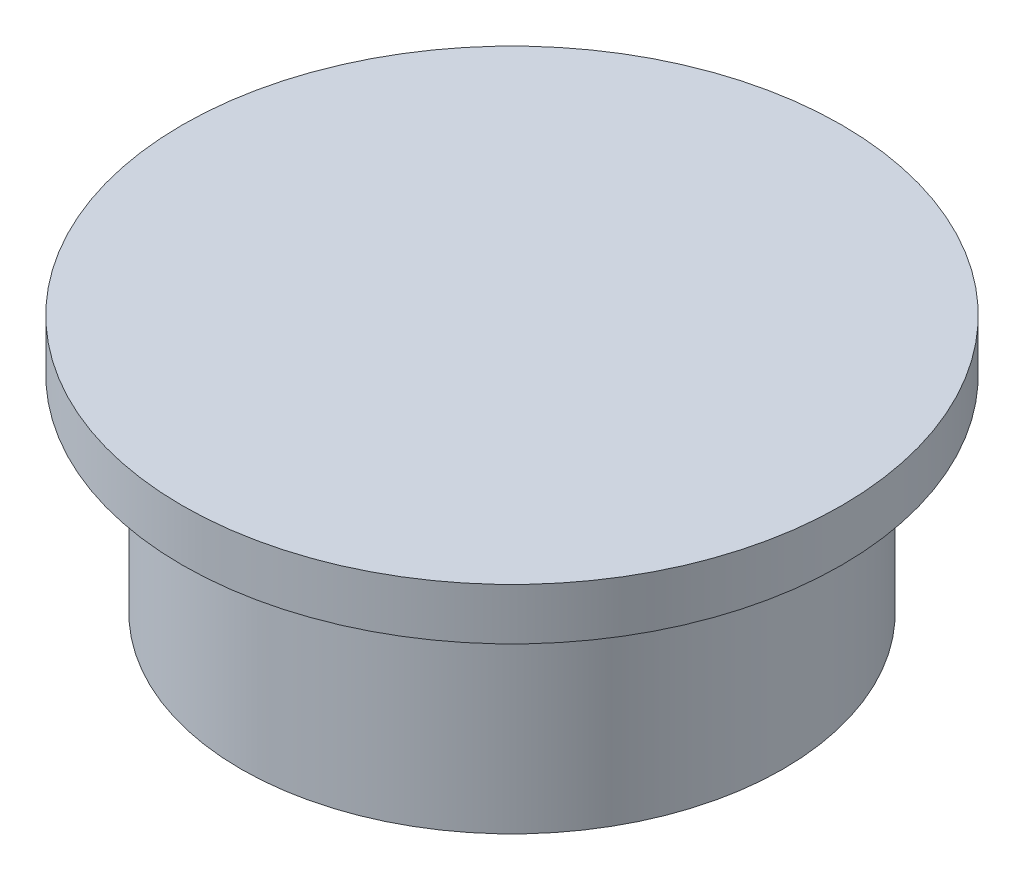
ISO-10303-21;
HEADER;
FILE_DESCRIPTION(('STEP AP214'),'2;1');
FILE_NAME('part.step','',(''),(''),'','','');
FILE_SCHEMA(('AUTOMOTIVE_DESIGN { 1 0 10303 214 1 1 1 1 }'));
ENDSEC;
DATA;
#1=APPLICATION_CONTEXT('core data for automotive mechanical design processes');
#2=APPLICATION_PROTOCOL_DEFINITION('international standard','automotive_design',2000,#1);
#3=PRODUCT_CONTEXT('',#1,'mechanical');
#4=PRODUCT('Part','Part','',(#3));
#5=PRODUCT_RELATED_PRODUCT_CATEGORY('part','',(#4));
#6=PRODUCT_DEFINITION_FORMATION('','',#4);
#7=PRODUCT_DEFINITION_CONTEXT('part definition',#1,'design');
#8=PRODUCT_DEFINITION('design','',#6,#7);
#9=PRODUCT_DEFINITION_SHAPE('','',#8);
#10=(LENGTH_UNIT() NAMED_UNIT(*) SI_UNIT(.MILLI.,.METRE.));
#11=(NAMED_UNIT(*) PLANE_ANGLE_UNIT() SI_UNIT($,.RADIAN.));
#12=(NAMED_UNIT(*) SI_UNIT($,.STERADIAN.) SOLID_ANGLE_UNIT());
#13=UNCERTAINTY_MEASURE_WITH_UNIT(LENGTH_MEASURE(1.E-05),#10,'distance_accuracy_value','');
#14=(GEOMETRIC_REPRESENTATION_CONTEXT(3) GLOBAL_UNCERTAINTY_ASSIGNED_CONTEXT((#13)) GLOBAL_UNIT_ASSIGNED_CONTEXT((#10,
#11,#12)) REPRESENTATION_CONTEXT('',''));
#15=CARTESIAN_POINT('',(0.,0.,0.));
#16=DIRECTION('',(0.,0.,1.));
#17=DIRECTION('',(1.,0.,0.));
#18=AXIS2_PLACEMENT_3D('',#15,#16,#17);
#19=CARTESIAN_POINT('',(0.,15.,0.));
#20=DIRECTION('',(0.,-1.,0.));
#21=DIRECTION('',(0.,0.,-1.));
#22=AXIS2_PLACEMENT_3D('',#19,#20,#21);
#23=PLANE('',#22);
#24=CARTESIAN_POINT('',(10.1331714344684,15.,3.74819249899276));
#25=CARTESIAN_POINT('',(7.98423562247712,15.,2.54909033571566));
#26=CARTESIAN_POINT('',(4.38190398424181,15.,0.604779847946047));
#27=CARTESIAN_POINT('',(1.44661254612541,15.,-1.66132992921648));
#28=B_SPLINE_CURVE_WITH_KNOTS('',3,(#24,#25,#26,#27),.UNSPECIFIED.,.F.,.F.,(4,4),
(0.0109043370463159,1.),.UNSPECIFIED.);
#29=CARTESIAN_POINT('',(10.1331714344684,15.,3.74819249899276));
#30=VERTEX_POINT('',#29);
#31=CARTESIAN_POINT('',(9.99686683376103,15.,3.67221370675083));
#32=VERTEX_POINT('',#31);
#33=EDGE_CURVE('E182',#30,#32,#28,.T.);
#34=ORIENTED_EDGE('',*,*,#33,.T.);
#35=CARTESIAN_POINT('',(0.,15.,0.));
#36=DIRECTION('',(0.,-1.,0.));
#37=DIRECTION('',(0.,0.,-1.));
#38=AXIS2_PLACEMENT_3D('',#35,#36,#37);
#39=CIRCLE('',#38,10.65);
#40=CARTESIAN_POINT('',(9.9680870996866,15.,3.74963192501099));
#41=VERTEX_POINT('',#40);
#42=EDGE_CURVE('E172',#32,#41,#39,.T.);
#43=ORIENTED_EDGE('',*,*,#42,.T.);
#44=DIRECTION('',(0.999961988744844,0.,-0.00871900599012528));
#45=VECTOR('',#44,1.);
#46=CARTESIAN_POINT('',(0.0334496051124429,15.,3.83625538150221));
#47=LINE('',#46,#45);
#48=EDGE_CURVE('E188',#41,#30,#47,.T.);
#49=ORIENTED_EDGE('',*,*,#48,.T.);
#50=EDGE_LOOP('',(#34,#43,#49));
#51=FACE_BOUND('',#50,.T.);
#52=ADVANCED_FACE('F48',(#51),#23,.F.);
#53=CARTESIAN_POINT('',(0.,17.,0.));
#54=DIRECTION('',(0.,1.,0.));
#55=DIRECTION('',(0.,0.,1.));
#56=AXIS2_PLACEMENT_3D('',#53,#54,#55);
#57=PLANE('',#56);
#58=CARTESIAN_POINT('',(-7.70690275443407,17.,-1.80839119653901));
#59=CARTESIAN_POINT('',(-8.13282046458095,17.,-1.53162241335836));
#60=CARTESIAN_POINT('',(-9.29507776566452,17.,-1.12036554925747));
#61=CARTESIAN_POINT('',(-10.0224617773798,17.,-0.728590804537964));
#62=B_SPLINE_CURVE_WITH_KNOTS('',3,(#58,#59,#60,#61),.UNSPECIFIED.,.F.,.F.,(4,4),
(0.109346460177382,0.840811762511879),.UNSPECIFIED.);
#63=CARTESIAN_POINT('',(-7.70690275443407,17.,-1.80839119653901));
#64=VERTEX_POINT('',#63);
#65=CARTESIAN_POINT('',(-10.0224617773798,17.,-0.728590804537966));
#66=VERTEX_POINT('',#65);
#67=EDGE_CURVE('E386',#64,#66,#62,.T.);
#68=ORIENTED_EDGE('',*,*,#67,.F.);
#69=CARTESIAN_POINT('',(-7.97934313992203,17.,-2.22764796315591));
#70=DIRECTION('',(0.,1.,0.));
#71=DIRECTION('',(0.,0.,1.));
#72=AXIS2_PLACEMENT_3D('',#69,#70,#71);
#73=CIRCLE('',#72,0.499999999998884);
#74=CARTESIAN_POINT('',(-7.5277335533392,17.,-2.01305816538964));
#75=VERTEX_POINT('',#74);
#76=EDGE_CURVE('E384',#64,#75,#73,.T.);
#77=ORIENTED_EDGE('',*,*,#76,.T.);
#78=CARTESIAN_POINT('',(-5.97356289784426,17.,-3.42764441158581));
#79=CARTESIAN_POINT('',(-6.70551439328931,17.,-3.18182806236595));
#80=CARTESIAN_POINT('',(-7.18803768607021,17.,-2.72795659847889));
#81=CARTESIAN_POINT('',(-7.5277335533392,17.,-2.01305816538964));
#82=B_SPLINE_CURVE_WITH_KNOTS('',3,(#78,#79,#80,#81),.UNSPECIFIED.,.F.,.F.,(4,4),
(0.175947617350418,0.967261409234941),.UNSPECIFIED.);
#83=CARTESIAN_POINT('',(-5.97356289784426,17.,-3.42764441158581));
#84=VERTEX_POINT('',#83);
#85=EDGE_CURVE('E245',#84,#75,#82,.T.);
#86=ORIENTED_EDGE('',*,*,#85,.F.);
#87=CARTESIAN_POINT('',(-5.33683695758252,17.,-1.53170662858842));
#88=DIRECTION('',(0.,1.,0.));
#89=DIRECTION('',(0.,0.,1.));
#90=AXIS2_PLACEMENT_3D('',#87,#88,#89);
#91=CIRCLE('',#90,1.99999999999981);
#92=CARTESIAN_POINT('',(-5.06636809167789,17.,-3.51333388732693));
#93=VERTEX_POINT('',#92);
#94=EDGE_CURVE('E374',#93,#84,#91,.T.);
#95=ORIENTED_EDGE('',*,*,#94,.F.);
#96=CARTESIAN_POINT('',(0.252246956629509,17.,-2.54649892275102));
#97=CARTESIAN_POINT('',(-0.967265157025587,17.,-2.5855446338096));
#98=CARTESIAN_POINT('',(-2.91173589828176,17.,-3.21925187810187));
#99=CARTESIAN_POINT('',(-5.06636809167788,17.,-3.51333388732693));
#100=B_SPLINE_CURVE_WITH_KNOTS('',3,(#96,#97,#98,#99),.UNSPECIFIED.,.F.,.F.,(4,4),(0.,
0.94465243398934),.UNSPECIFIED.);
#101=CARTESIAN_POINT('',(0.252246943565959,17.,-2.54649892265936));
#102=VERTEX_POINT('',#101);
#103=EDGE_CURVE('E367',#102,#93,#100,.T.);
#104=ORIENTED_EDGE('',*,*,#103,.F.);
#105=CARTESIAN_POINT('',(-437051.448594121,17.,-899448.046076552));
#106=CARTESIAN_POINT('',(440922.130501443,17.,897544.135699193));
#107=CARTESIAN_POINT('',(-444773.896505409,17.,-895654.418476363));
#108=B_SPLINE_CURVE_WITH_KNOTS('',2,(#105,#106,#107),.UNSPECIFIED.,.F.,.F.,(3,3),(0.,1.),.UNSPECIFIED.);
#109=CARTESIAN_POINT('',(2.98484379670261,17.,-2.89801067573242));
#110=VERTEX_POINT('',#109);
#111=EDGE_CURVE('E359',#110,#102,#108,.T.);
#112=ORIENTED_EDGE('',*,*,#111,.F.);
#113=CARTESIAN_POINT('',(1.44657608810188,17.,-1.81961275599096));
#114=CARTESIAN_POINT('',(1.6922336041153,17.,-2.00944650442161));
#115=CARTESIAN_POINT('',(2.25567544120908,17.,-2.35606123667802));
#116=CARTESIAN_POINT('',(2.98484376661068,17.,-2.89801066775086));
#117=B_SPLINE_CURVE_WITH_KNOTS('',3,(#113,#114,#115,#116),.UNSPECIFIED.,.F.,.F.,(4,4),
(0.144955644440009,1.),.UNSPECIFIED.);
#118=CARTESIAN_POINT('',(1.44657608563146,17.,-1.81961275917009));
#119=VERTEX_POINT('',#118);
#120=EDGE_CURVE('E354',#119,#110,#117,.T.);
#121=ORIENTED_EDGE('',*,*,#120,.F.);
#122=CARTESIAN_POINT('',(1.50772234796804,17.,-1.74048542250789));
#123=DIRECTION('',(0.,1.,0.));
#124=DIRECTION('',(0.,0.,1.));
#125=AXIS2_PLACEMENT_3D('',#122,#123,#124);
#126=CIRCLE('',#125,0.100000004024937);
#127=CARTESIAN_POINT('',(1.44661254430695,17.,-1.66132992553206));
#128=VERTEX_POINT('',#127);
#129=EDGE_CURVE('E349',#119,#128,#126,.T.);
#130=ORIENTED_EDGE('',*,*,#129,.T.);
#131=CARTESIAN_POINT('',(10.1331714344684,17.,3.74819249899276));
#132=CARTESIAN_POINT('',(7.98423562247712,17.,2.54909033571566));
#133=CARTESIAN_POINT('',(4.38190398424181,17.,0.604779847946047));
#134=CARTESIAN_POINT('',(1.44661254612541,17.,-1.66132992921648));
#135=B_SPLINE_CURVE_WITH_KNOTS('',3,(#131,#132,#133,#134),.UNSPECIFIED.,.F.,.F.,(4,4),
(0.0109043370463159,1.),.UNSPECIFIED.);
#136=CARTESIAN_POINT('',(10.1331714344684,17.,3.74819249899276));
#137=VERTEX_POINT('',#136);
#138=EDGE_CURVE('E333',#137,#128,#135,.T.);
#139=ORIENTED_EDGE('',*,*,#138,.F.);
#140=DIRECTION('',(0.999961988744844,0.,-0.00871900599012528));
#141=VECTOR('',#140,1.);
#142=CARTESIAN_POINT('',(0.0334496051124429,17.,3.83625538150221));
#143=LINE('',#142,#141);
#144=CARTESIAN_POINT('',(-3.27342147947646,17.,3.86508910630338));
#145=VERTEX_POINT('',#144);
#146=EDGE_CURVE('E330',#145,#137,#143,.T.);
#147=ORIENTED_EDGE('',*,*,#146,.F.);
#148=CARTESIAN_POINT('',(-7.52773355333564,17.,-0.0785493574014385));
#149=CARTESIAN_POINT('',(-6.02135132804977,17.,-0.0345375374684732));
#150=CARTESIAN_POINT('',(-5.03417295231662,17.,1.16113154394786));
#151=CARTESIAN_POINT('',(-3.27342147947646,17.,3.86508910630338));
#152=B_SPLINE_CURVE_WITH_KNOTS('',3,(#148,#149,#150,#151),.UNSPECIFIED.,.F.,.F.,(4,4),(0.,1.),.UNSPECIFIED.);
#153=CARTESIAN_POINT('',(-7.52773355333564,17.,-0.0785493574014385));
#154=VERTEX_POINT('',#153);
#155=EDGE_CURVE('E328',#154,#145,#152,.T.);
#156=ORIENTED_EDGE('',*,*,#155,.F.);
#157=CARTESIAN_POINT('',(-9.00135959818123,17.,0.0966449292042534));
#158=CARTESIAN_POINT('',(-8.60951132692284,17.,0.0109841909571523));
#159=CARTESIAN_POINT('',(-8.14744293446896,17.,-0.0430608363407199));
#160=CARTESIAN_POINT('',(-7.52773355333564,17.,-0.0785493574014385));
#161=B_SPLINE_CURVE_WITH_KNOTS('',3,(#157,#158,#159,#160),.UNSPECIFIED.,.F.,.F.,(4,4),
(0.366671919414141,1.),.UNSPECIFIED.);
#162=CARTESIAN_POINT('',(-9.00135959818123,17.,0.0966449292042514));
#163=VERTEX_POINT('',#162);
#164=EDGE_CURVE('E331',#163,#154,#161,.T.);
#165=ORIENTED_EDGE('',*,*,#164,.F.);
#166=CARTESIAN_POINT('',(-8.84118699715415,17.,0.829341822796713));
#167=DIRECTION('',(0.,1.,0.));
#168=DIRECTION('',(0.,0.,1.));
#169=AXIS2_PLACEMENT_3D('',#166,#167,#168);
#170=CIRCLE('',#169,0.749999999999881);
#171=CARTESIAN_POINT('',(-9.589622683719,17.,0.877756934859196));
#172=VERTEX_POINT('',#171);
#173=EDGE_CURVE('E335',#163,#172,#170,.T.);
#174=ORIENTED_EDGE('',*,*,#173,.T.);
#175=DIRECTION('',(-0.0645534827440402,0.,-0.997914248753677));
#176=VECTOR('',#175,1.);
#177=CARTESIAN_POINT('',(-9.60620535083817,17.,0.621410118279718));
#178=LINE('',#177,#176);
#179=CARTESIAN_POINT('',(-9.55587963421446,17.,1.39938130686246));
#180=VERTEX_POINT('',#179);
#181=EDGE_CURVE('E408',#180,#172,#178,.T.);
#182=ORIENTED_EDGE('',*,*,#181,.F.);
#183=DIRECTION('',(0.419665574548186,0.,0.907678800864679));
#184=VECTOR('',#183,1.);
#185=CARTESIAN_POINT('',(-8.40596030078368,17.,3.88649834709927));
#186=LINE('',#185,#184);
#187=CARTESIAN_POINT('',(-10.2392013343247,17.,-0.0785493574019338));
#188=VERTEX_POINT('',#187);
#189=EDGE_CURVE('E70',#188,#180,#186,.T.);
#190=ORIENTED_EDGE('',*,*,#189,.F.);
#191=CARTESIAN_POINT('',(-9.78536193389068,17.,-0.288382144674837));
#192=DIRECTION('',(0.,1.,0.));
#193=DIRECTION('',(0.,0.,1.));
#194=AXIS2_PLACEMENT_3D('',#191,#192,#193);
#195=CIRCLE('',#194,0.500000000001046);
#196=EDGE_CURVE('E389',#66,#188,#195,.T.);
#197=ORIENTED_EDGE('',*,*,#196,.F.);
#198=EDGE_LOOP('',(#68,#77,#86,#95,#104,#112,#121,#130,#139,#147,#156,#165,#174,#182,#190,#197));
#199=FACE_BOUND('',#198,.T.);
#200=ADVANCED_FACE('F383',(#199),#57,.F.);
#201=CARTESIAN_POINT('',(0.0334496051124429,13.7,3.83625538150221));
#202=DIRECTION('',(0.00871900599012528,0.,0.999961988744844));
#203=DIRECTION('',(0.999961988744844,0.,-0.00871900599012528));
#204=AXIS2_PLACEMENT_3D('',#201,#202,#203);
#205=PLANE('',#204);
#206=DIRECTION('',(0.,1.,0.));
#207=VECTOR('',#206,1.);
#208=CARTESIAN_POINT('',(10.1331714344684,13.7,3.74819249899276));
#209=LINE('',#208,#207);
#210=EDGE_CURVE('E270',#30,#137,#209,.T.);
#211=ORIENTED_EDGE('',*,*,#210,.F.);
#212=ORIENTED_EDGE('',*,*,#48,.F.);
#213=CARTESIAN_POINT('',(-3.27342147947646,15.,3.86508910630338));
#214=VERTEX_POINT('',#213);
#215=EDGE_CURVE('E170',#214,#41,#47,.T.);
#216=ORIENTED_EDGE('',*,*,#215,.F.);
#217=DIRECTION('',(0.,1.,0.));
#218=VECTOR('',#217,1.);
#219=CARTESIAN_POINT('',(-3.27342147947646,13.7,3.86508910630338));
#220=LINE('',#219,#218);
#221=EDGE_CURVE('E272',#214,#145,#220,.T.);
#222=ORIENTED_EDGE('',*,*,#221,.T.);
#223=ORIENTED_EDGE('',*,*,#146,.T.);
#224=EDGE_LOOP('',(#211,#212,#216,#222,#223));
#225=FACE_BOUND('',#224,.T.);
#226=ADVANCED_FACE('F324',(#225),#205,.F.);
#227=CARTESIAN_POINT('',(10.1331714344684,13.7,3.74819249899276));
#228=CARTESIAN_POINT('',(7.98423562247712,13.7,2.54909033571566));
#229=CARTESIAN_POINT('',(4.38190398424181,13.7,0.604779847946047));
#230=CARTESIAN_POINT('',(1.44661254612541,13.7,-1.66132992921648));
#231=B_SPLINE_CURVE_WITH_KNOTS('',3,(#227,#228,#229,#230),.UNSPECIFIED.,.F.,.F.,(4,4),
(0.0109043370463159,1.),.UNSPECIFIED.);
#232=DIRECTION('',(0.,1.,0.));
#233=VECTOR('',#232,1.);
#234=SURFACE_OF_LINEAR_EXTRUSION('',#231,#233);
#235=ORIENTED_EDGE('',*,*,#33,.F.);
#236=ORIENTED_EDGE('',*,*,#210,.T.);
#237=ORIENTED_EDGE('',*,*,#138,.T.);
#238=DIRECTION('',(0.,1.,0.));
#239=VECTOR('',#238,1.);
#240=CARTESIAN_POINT('',(1.44661254430695,13.7,-1.66132992553206));
#241=LINE('',#240,#239);
#242=CARTESIAN_POINT('',(1.44661254430695,15.,-1.66132992553206));
#243=VERTEX_POINT('',#242);
#244=EDGE_CURVE('E186',#243,#128,#241,.T.);
#245=ORIENTED_EDGE('',*,*,#244,.F.);
#246=EDGE_CURVE('E167',#32,#243,#28,.T.);
#247=ORIENTED_EDGE('',*,*,#246,.F.);
#248=EDGE_LOOP('',(#235,#236,#237,#245,#247));
#249=FACE_BOUND('',#248,.T.);
#250=ADVANCED_FACE('F181',(#249),#234,.F.);
#251=CARTESIAN_POINT('',(-7.70690275443407,13.7,-1.80839119653901));
#252=CARTESIAN_POINT('',(-8.13282046458095,13.7,-1.53162241335836));
#253=CARTESIAN_POINT('',(-9.29507776566452,13.7,-1.12036554925747));
#254=CARTESIAN_POINT('',(-10.0224617773798,13.7,-0.728590804537964));
#255=B_SPLINE_CURVE_WITH_KNOTS('',3,(#251,#252,#253,#254),.UNSPECIFIED.,.F.,.F.,(4,4),
(0.109346460177382,0.840811762511879),.UNSPECIFIED.);
#256=DIRECTION('',(0.,1.,0.));
#257=VECTOR('',#256,1.);
#258=SURFACE_OF_LINEAR_EXTRUSION('',#255,#257);
#259=DIRECTION('',(0.,1.,0.));
#260=VECTOR('',#259,1.);
#261=CARTESIAN_POINT('',(-7.70690275443407,13.7,-1.80839119653901));
#262=LINE('',#261,#260);
#263=CARTESIAN_POINT('',(-7.70690275443407,15.,-1.80839119653901));
#264=VERTEX_POINT('',#263);
#265=EDGE_CURVE('E238',#264,#64,#262,.T.);
#266=ORIENTED_EDGE('',*,*,#265,.T.);
#267=ORIENTED_EDGE('',*,*,#67,.T.);
#268=DIRECTION('',(0.,1.,0.));
#269=VECTOR('',#268,1.);
#270=CARTESIAN_POINT('',(-10.0224617773798,13.7,-0.728590804537966));
#271=LINE('',#270,#269);
#272=CARTESIAN_POINT('',(-10.0224617773798,15.,-0.728590804537964));
#273=VERTEX_POINT('',#272);
#274=EDGE_CURVE('E289',#273,#66,#271,.T.);
#275=ORIENTED_EDGE('',*,*,#274,.F.);
#276=CARTESIAN_POINT('',(-7.70690275443407,15.,-1.80839119653901));
#277=CARTESIAN_POINT('',(-8.13282046458095,15.,-1.53162241335836));
#278=CARTESIAN_POINT('',(-9.29507776566452,15.,-1.12036554925747));
#279=CARTESIAN_POINT('',(-10.0224617773798,15.,-0.728590804537964));
#280=B_SPLINE_CURVE_WITH_KNOTS('',3,(#276,#277,#278,#279),.UNSPECIFIED.,.F.,.F.,(4,4),
(0.109346460177382,0.840811762511879),.UNSPECIFIED.);
#281=EDGE_CURVE('E246',#264,#273,#280,.T.);
#282=ORIENTED_EDGE('',*,*,#281,.F.);
#283=EDGE_LOOP('',(#266,#267,#275,#282));
#284=FACE_BOUND('',#283,.T.);
#285=ADVANCED_FACE('F428',(#284),#258,.F.);
#286=CARTESIAN_POINT('',(-9.78536193389068,13.7,-0.288382144674837));
#287=DIRECTION('',(0.,1.,0.));
#288=DIRECTION('',(0.,0.,1.));
#289=AXIS2_PLACEMENT_3D('',#286,#287,#288);
#290=CYLINDRICAL_SURFACE('',#289,0.500000000001046);
#291=ORIENTED_EDGE('',*,*,#274,.T.);
#292=ORIENTED_EDGE('',*,*,#196,.T.);
#293=DIRECTION('',(0.,1.,0.));
#294=VECTOR('',#293,1.);
#295=CARTESIAN_POINT('',(-10.2392013343247,13.7,-0.0785493574019338));
#296=LINE('',#295,#294);
#297=CARTESIAN_POINT('',(-10.2392013343247,15.,-0.0785493574019338));
#298=VERTEX_POINT('',#297);
#299=EDGE_CURVE('E287',#298,#188,#296,.T.);
#300=ORIENTED_EDGE('',*,*,#299,.F.);
#301=CARTESIAN_POINT('',(-9.78536193389068,15.,-0.288382144674837));
#302=DIRECTION('',(0.,1.,0.));
#303=DIRECTION('',(0.,0.,1.));
#304=AXIS2_PLACEMENT_3D('',#301,#302,#303);
#305=CIRCLE('',#304,0.500000000001046);
#306=EDGE_CURVE('E249',#273,#298,#305,.T.);
#307=ORIENTED_EDGE('',*,*,#306,.F.);
#308=EDGE_LOOP('',(#291,#292,#300,#307));
#309=FACE_BOUND('',#308,.T.);
#310=ADVANCED_FACE('F425',(#309),#290,.F.);
#311=CARTESIAN_POINT('',(-8.40596030078368,13.7,3.88649834709927));
#312=DIRECTION('',(-0.907678800864679,0.,0.419665574548186));
#313=DIRECTION('',(0.419665574548186,0.,0.907678800864679));
#314=AXIS2_PLACEMENT_3D('',#311,#312,#313);
#315=PLANE('',#314);
#316=ORIENTED_EDGE('',*,*,#299,.T.);
#317=ORIENTED_EDGE('',*,*,#189,.T.);
#318=DIRECTION('',(0.,1.,0.));
#319=VECTOR('',#318,1.);
#320=CARTESIAN_POINT('',(-9.55587963421446,13.7,1.39938130686246));
#321=LINE('',#320,#319);
#322=CARTESIAN_POINT('',(-9.55587963421446,15.,1.39938130686246));
#323=VERTEX_POINT('',#322);
#324=EDGE_CURVE('E284',#323,#180,#321,.T.);
#325=ORIENTED_EDGE('',*,*,#324,.F.);
#326=DIRECTION('',(0.419665574548186,0.,0.907678800864679));
#327=VECTOR('',#326,1.);
#328=CARTESIAN_POINT('',(-8.40596030078368,15.,3.88649834709927));
#329=LINE('',#328,#327);
#330=EDGE_CURVE('E299',#298,#323,#329,.T.);
#331=ORIENTED_EDGE('',*,*,#330,.F.);
#332=EDGE_LOOP('',(#316,#317,#325,#331));
#333=FACE_BOUND('',#332,.T.);
#334=ADVANCED_FACE('F421',(#333),#315,.F.);
#335=CARTESIAN_POINT('',(-9.60620535083817,13.7,0.621410118279718));
#336=DIRECTION('',(0.997914248753677,0.,-0.0645534827440402));
#337=DIRECTION('',(-0.0645534827440402,0.,-0.997914248753677));
#338=AXIS2_PLACEMENT_3D('',#335,#336,#337);
#339=PLANE('',#338);
#340=ORIENTED_EDGE('',*,*,#324,.T.);
#341=ORIENTED_EDGE('',*,*,#181,.T.);
#342=DIRECTION('',(0.,1.,0.));
#343=VECTOR('',#342,1.);
#344=CARTESIAN_POINT('',(-9.589622683719,13.7,0.877756934859196));
#345=LINE('',#344,#343);
#346=CARTESIAN_POINT('',(-9.589622683719,15.,0.877756934859196));
#347=VERTEX_POINT('',#346);
#348=EDGE_CURVE('E281',#347,#172,#345,.T.);
#349=ORIENTED_EDGE('',*,*,#348,.F.);
#350=DIRECTION('',(-0.0645534827440402,0.,-0.997914248753677));
#351=VECTOR('',#350,1.);
#352=CARTESIAN_POINT('',(-9.60620535083817,15.,0.621410118279719));
#353=LINE('',#352,#351);
#354=EDGE_CURVE('E301',#323,#347,#353,.T.);
#355=ORIENTED_EDGE('',*,*,#354,.F.);
#356=EDGE_LOOP('',(#340,#341,#349,#355));
#357=FACE_BOUND('',#356,.T.);
#358=ADVANCED_FACE('F417',(#357),#339,.F.);
#359=CARTESIAN_POINT('',(-8.84118699715415,13.7,0.829341822796713));
#360=DIRECTION('',(0.,1.,0.));
#361=DIRECTION('',(0.,0.,1.));
#362=AXIS2_PLACEMENT_3D('',#359,#360,#361);
#363=CYLINDRICAL_SURFACE('',#362,0.749999999999881);
#364=CARTESIAN_POINT('',(-8.84118699715415,15.,0.829341822796713));
#365=DIRECTION('',(0.,1.,0.));
#366=DIRECTION('',(0.,0.,1.));
#367=AXIS2_PLACEMENT_3D('',#364,#365,#366);
#368=CIRCLE('',#367,0.749999999999881);
#369=CARTESIAN_POINT('',(-9.00135959818123,15.,0.0966449292042514));
#370=VERTEX_POINT('',#369);
#371=EDGE_CURVE('E303',#370,#347,#368,.T.);
#372=ORIENTED_EDGE('',*,*,#371,.T.);
#373=ORIENTED_EDGE('',*,*,#348,.T.);
#374=ORIENTED_EDGE('',*,*,#173,.F.);
#375=DIRECTION('',(0.,1.,0.));
#376=VECTOR('',#375,1.);
#377=CARTESIAN_POINT('',(-9.00135959818123,13.7,0.0966449292042514));
#378=LINE('',#377,#376);
#379=EDGE_CURVE('E278',#370,#163,#378,.T.);
#380=ORIENTED_EDGE('',*,*,#379,.F.);
#381=EDGE_LOOP('',(#372,#373,#374,#380));
#382=FACE_BOUND('',#381,.T.);
#383=ADVANCED_FACE('F414',(#382),#363,.T.);
#384=CARTESIAN_POINT('',(-9.00135959818123,13.7,0.0966449292042534));
#385=CARTESIAN_POINT('',(-8.60951132692284,13.7,0.0109841909571523));
#386=CARTESIAN_POINT('',(-8.14744293446896,13.7,-0.0430608363407199));
#387=CARTESIAN_POINT('',(-7.52773355333564,13.7,-0.0785493574014385));
#388=B_SPLINE_CURVE_WITH_KNOTS('',3,(#384,#385,#386,#387),.UNSPECIFIED.,.F.,.F.,(4,4),
(0.366671919414141,1.),.UNSPECIFIED.);
#389=DIRECTION('',(0.,1.,0.));
#390=VECTOR('',#389,1.);
#391=SURFACE_OF_LINEAR_EXTRUSION('',#388,#390);
#392=ORIENTED_EDGE('',*,*,#379,.T.);
#393=ORIENTED_EDGE('',*,*,#164,.T.);
#394=DIRECTION('',(0.,1.,0.));
#395=VECTOR('',#394,1.);
#396=CARTESIAN_POINT('',(-7.52773355333564,13.7,-0.0785493574014385));
#397=LINE('',#396,#395);
#398=CARTESIAN_POINT('',(-7.52773355333564,15.,-0.0785493574014385));
#399=VERTEX_POINT('',#398);
#400=EDGE_CURVE('E275',#399,#154,#397,.T.);
#401=ORIENTED_EDGE('',*,*,#400,.F.);
#402=CARTESIAN_POINT('',(-9.00135959818123,15.,0.0966449292042534));
#403=CARTESIAN_POINT('',(-8.60951132692284,15.,0.0109841909571523));
#404=CARTESIAN_POINT('',(-8.14744293446896,15.,-0.0430608363407199));
#405=CARTESIAN_POINT('',(-7.52773355333564,15.,-0.0785493574014385));
#406=B_SPLINE_CURVE_WITH_KNOTS('',3,(#402,#403,#404,#405),.UNSPECIFIED.,.F.,.F.,(4,4),
(0.366671919414141,1.),.UNSPECIFIED.);
#407=EDGE_CURVE('E306',#370,#399,#406,.T.);
#408=ORIENTED_EDGE('',*,*,#407,.F.);
#409=EDGE_LOOP('',(#392,#393,#401,#408));
#410=FACE_BOUND('',#409,.T.);
#411=ADVANCED_FACE('F430',(#410),#391,.F.);
#412=CARTESIAN_POINT('',(-7.52773355333564,13.7,-0.0785493574014385));
#413=CARTESIAN_POINT('',(-6.02135132804977,13.7,-0.0345375374684732));
#414=CARTESIAN_POINT('',(-5.03417295231662,13.7,1.16113154394786));
#415=CARTESIAN_POINT('',(-3.27342147947646,13.7,3.86508910630338));
#416=B_SPLINE_CURVE_WITH_KNOTS('',3,(#412,#413,#414,#415),.UNSPECIFIED.,.F.,.F.,(4,4),(0.,1.),.UNSPECIFIED.);
#417=DIRECTION('',(0.,1.,0.));
#418=VECTOR('',#417,1.);
#419=SURFACE_OF_LINEAR_EXTRUSION('',#416,#418);
#420=ORIENTED_EDGE('',*,*,#400,.T.);
#421=ORIENTED_EDGE('',*,*,#155,.T.);
#422=ORIENTED_EDGE('',*,*,#221,.F.);
#423=CARTESIAN_POINT('',(-7.52773355333564,15.,-0.0785493574014385));
#424=CARTESIAN_POINT('',(-6.02135132804977,15.,-0.0345375374684732));
#425=CARTESIAN_POINT('',(-5.03417295231662,15.,1.16113154394786));
#426=CARTESIAN_POINT('',(-3.27342147947646,15.,3.86508910630338));
#427=B_SPLINE_CURVE_WITH_KNOTS('',3,(#423,#424,#425,#426),.UNSPECIFIED.,.F.,.F.,(4,4),(0.,1.),.UNSPECIFIED.);
#428=EDGE_CURVE('E309',#399,#214,#427,.T.);
#429=ORIENTED_EDGE('',*,*,#428,.F.);
#430=EDGE_LOOP('',(#420,#421,#422,#429));
#431=FACE_BOUND('',#430,.T.);
#432=ADVANCED_FACE('F327',(#431),#419,.F.);
#433=CARTESIAN_POINT('',(1.50772234796804,13.7,-1.74048542250789));
#434=DIRECTION('',(0.,1.,0.));
#435=DIRECTION('',(0.,0.,1.));
#436=AXIS2_PLACEMENT_3D('',#433,#434,#435);
#437=CYLINDRICAL_SURFACE('',#436,0.100000004024937);
#438=CARTESIAN_POINT('',(1.50772234796804,15.,-1.74048542250789));
#439=DIRECTION('',(0.,1.,0.));
#440=DIRECTION('',(0.,0.,1.));
#441=AXIS2_PLACEMENT_3D('',#438,#439,#440);
#442=CIRCLE('',#441,0.100000004024937);
#443=CARTESIAN_POINT('',(1.44657608563146,15.,-1.81961275917009));
#444=VERTEX_POINT('',#443);
#445=EDGE_CURVE('E189',#444,#243,#442,.T.);
#446=ORIENTED_EDGE('',*,*,#445,.T.);
#447=ORIENTED_EDGE('',*,*,#244,.T.);
#448=ORIENTED_EDGE('',*,*,#129,.F.);
#449=DIRECTION('',(0.,1.,0.));
#450=VECTOR('',#449,1.);
#451=CARTESIAN_POINT('',(1.44657608563146,13.7,-1.81961275917009));
#452=LINE('',#451,#450);
#453=EDGE_CURVE('E266',#444,#119,#452,.T.);
#454=ORIENTED_EDGE('',*,*,#453,.F.);
#455=EDGE_LOOP('',(#446,#447,#448,#454));
#456=FACE_BOUND('',#455,.T.);
#457=ADVANCED_FACE('F437',(#456),#437,.T.);
#458=CARTESIAN_POINT('',(1.44657608810188,13.7,-1.81961275599096));
#459=CARTESIAN_POINT('',(1.6922336041153,13.7,-2.00944650442161));
#460=CARTESIAN_POINT('',(2.25567544120908,13.7,-2.35606123667802));
#461=CARTESIAN_POINT('',(2.98484376661068,13.7,-2.89801066775086));
#462=B_SPLINE_CURVE_WITH_KNOTS('',3,(#458,#459,#460,#461),.UNSPECIFIED.,.F.,.F.,(4,4),
(0.144955644440009,1.),.UNSPECIFIED.);
#463=DIRECTION('',(0.,1.,0.));
#464=VECTOR('',#463,1.);
#465=SURFACE_OF_LINEAR_EXTRUSION('',#462,#464);
#466=ORIENTED_EDGE('',*,*,#453,.T.);
#467=ORIENTED_EDGE('',*,*,#120,.T.);
#468=DIRECTION('',(0.,1.,0.));
#469=VECTOR('',#468,1.);
#470=CARTESIAN_POINT('',(2.98484379670261,13.7,-2.89801067573242));
#471=LINE('',#470,#469);
#472=CARTESIAN_POINT('',(2.98484379670261,15.,-2.89801067573242));
#473=VERTEX_POINT('',#472);
#474=EDGE_CURVE('E263',#473,#110,#471,.T.);
#475=ORIENTED_EDGE('',*,*,#474,.F.);
#476=CARTESIAN_POINT('',(1.44657608810188,15.,-1.81961275599096));
#477=CARTESIAN_POINT('',(1.6922336041153,15.,-2.00944650442161));
#478=CARTESIAN_POINT('',(2.25567544120908,15.,-2.35606123667802));
#479=CARTESIAN_POINT('',(2.98484376661068,15.,-2.89801066775086));
#480=B_SPLINE_CURVE_WITH_KNOTS('',3,(#476,#477,#478,#479),.UNSPECIFIED.,.F.,.F.,(4,4),
(0.144955644440009,1.),.UNSPECIFIED.);
#481=EDGE_CURVE('E190',#444,#473,#480,.T.);
#482=ORIENTED_EDGE('',*,*,#481,.F.);
#483=EDGE_LOOP('',(#466,#467,#475,#482));
#484=FACE_BOUND('',#483,.T.);
#485=ADVANCED_FACE('F495',(#484),#465,.F.);
#486=CARTESIAN_POINT('',(-437051.448594121,13.7,-899448.046076552));
#487=CARTESIAN_POINT('',(440922.130501443,13.7,897544.135699193));
#488=CARTESIAN_POINT('',(-444773.896505409,13.7,-895654.418476363));
#489=B_SPLINE_CURVE_WITH_KNOTS('',2,(#486,#487,#488),.UNSPECIFIED.,.F.,.F.,(3,3),(0.,1.),.UNSPECIFIED.);
#490=DIRECTION('',(0.,1.,0.));
#491=VECTOR('',#490,1.);
#492=SURFACE_OF_LINEAR_EXTRUSION('',#489,#491);
#493=ORIENTED_EDGE('',*,*,#474,.T.);
#494=ORIENTED_EDGE('',*,*,#111,.T.);
#495=DIRECTION('',(0.,1.,0.));
#496=VECTOR('',#495,1.);
#497=CARTESIAN_POINT('',(0.252246943565959,13.7,-2.54649892265936));
#498=LINE('',#497,#496);
#499=CARTESIAN_POINT('',(0.252246943565959,15.,-2.54649892265936));
#500=VERTEX_POINT('',#499);
#501=EDGE_CURVE('E260',#500,#102,#498,.T.);
#502=ORIENTED_EDGE('',*,*,#501,.F.);
#503=CARTESIAN_POINT('',(-437051.448594121,15.,-899448.046076552));
#504=CARTESIAN_POINT('',(440922.130501443,15.,897544.135699193));
#505=CARTESIAN_POINT('',(-444773.896505409,15.,-895654.418476363));
#506=B_SPLINE_CURVE_WITH_KNOTS('',2,(#503,#504,#505),.UNSPECIFIED.,.F.,.F.,(3,3),(0.,1.),.UNSPECIFIED.);
#507=EDGE_CURVE('E203',#473,#500,#506,.T.);
#508=ORIENTED_EDGE('',*,*,#507,.F.);
#509=EDGE_LOOP('',(#493,#494,#502,#508));
#510=FACE_BOUND('',#509,.T.);
#511=ADVANCED_FACE('F467',(#510),#492,.F.);
#512=CARTESIAN_POINT('',(0.252246956629509,13.7,-2.54649892275102));
#513=CARTESIAN_POINT('',(-0.967265157025587,13.7,-2.5855446338096));
#514=CARTESIAN_POINT('',(-2.91173589828176,13.7,-3.21925187810187));
#515=CARTESIAN_POINT('',(-5.06636809167788,13.7,-3.51333388732693));
#516=B_SPLINE_CURVE_WITH_KNOTS('',3,(#512,#513,#514,#515),.UNSPECIFIED.,.F.,.F.,(4,4),(0.,
0.94465243398934),.UNSPECIFIED.);
#517=DIRECTION('',(0.,1.,0.));
#518=VECTOR('',#517,1.);
#519=SURFACE_OF_LINEAR_EXTRUSION('',#516,#518);
#520=ORIENTED_EDGE('',*,*,#501,.T.);
#521=ORIENTED_EDGE('',*,*,#103,.T.);
#522=DIRECTION('',(0.,1.,0.));
#523=VECTOR('',#522,1.);
#524=CARTESIAN_POINT('',(-5.06636809167789,13.7,-3.51333388732693));
#525=LINE('',#524,#523);
#526=CARTESIAN_POINT('',(-5.06636809167789,15.,-3.51333388732693));
#527=VERTEX_POINT('',#526);
#528=EDGE_CURVE('E251',#527,#93,#525,.T.);
#529=ORIENTED_EDGE('',*,*,#528,.F.);
#530=CARTESIAN_POINT('',(0.252246956629509,15.,-2.54649892275102));
#531=CARTESIAN_POINT('',(-0.967265157025587,15.,-2.5855446338096));
#532=CARTESIAN_POINT('',(-2.91173589828176,15.,-3.21925187810187));
#533=CARTESIAN_POINT('',(-5.06636809167788,15.,-3.51333388732693));
#534=B_SPLINE_CURVE_WITH_KNOTS('',3,(#530,#531,#532,#533),.UNSPECIFIED.,.F.,.F.,(4,4),(0.,
0.94465243398934),.UNSPECIFIED.);
#535=EDGE_CURVE('E210',#500,#527,#534,.T.);
#536=ORIENTED_EDGE('',*,*,#535,.F.);
#537=EDGE_LOOP('',(#520,#521,#529,#536));
#538=FACE_BOUND('',#537,.T.);
#539=ADVANCED_FACE('F464',(#538),#519,.F.);
#540=CARTESIAN_POINT('',(-5.33683695758252,13.7,-1.53170662858842));
#541=DIRECTION('',(0.,1.,0.));
#542=DIRECTION('',(0.,0.,1.));
#543=AXIS2_PLACEMENT_3D('',#540,#541,#542);
#544=CYLINDRICAL_SURFACE('',#543,1.99999999999981);
#545=ORIENTED_EDGE('',*,*,#528,.T.);
#546=ORIENTED_EDGE('',*,*,#94,.T.);
#547=DIRECTION('',(0.,1.,0.));
#548=VECTOR('',#547,1.);
#549=CARTESIAN_POINT('',(-5.97356289784426,13.7,-3.42764441158581));
#550=LINE('',#549,#548);
#551=CARTESIAN_POINT('',(-5.97356289784426,15.,-3.42764441158581));
#552=VERTEX_POINT('',#551);
#553=EDGE_CURVE('E247',#552,#84,#550,.T.);
#554=ORIENTED_EDGE('',*,*,#553,.F.);
#555=CARTESIAN_POINT('',(-5.33683695758252,15.,-1.53170662858842));
#556=DIRECTION('',(0.,1.,0.));
#557=DIRECTION('',(0.,0.,1.));
#558=AXIS2_PLACEMENT_3D('',#555,#556,#557);
#559=CIRCLE('',#558,1.99999999999981);
#560=EDGE_CURVE('E217',#527,#552,#559,.T.);
#561=ORIENTED_EDGE('',*,*,#560,.F.);
#562=EDGE_LOOP('',(#545,#546,#554,#561));
#563=FACE_BOUND('',#562,.T.);
#564=ADVANCED_FACE('F380',(#563),#544,.F.);
#565=CARTESIAN_POINT('',(-5.97356289784426,13.7,-3.42764441158581));
#566=CARTESIAN_POINT('',(-6.70551439328931,13.7,-3.18182806236595));
#567=CARTESIAN_POINT('',(-7.18803768607021,13.7,-2.72795659847889));
#568=CARTESIAN_POINT('',(-7.5277335533392,13.7,-2.01305816538964));
#569=B_SPLINE_CURVE_WITH_KNOTS('',3,(#565,#566,#567,#568),.UNSPECIFIED.,.F.,.F.,(4,4),
(0.175947617350418,0.967261409234941),.UNSPECIFIED.);
#570=DIRECTION('',(0.,1.,0.));
#571=VECTOR('',#570,1.);
#572=SURFACE_OF_LINEAR_EXTRUSION('',#569,#571);
#573=ORIENTED_EDGE('',*,*,#553,.T.);
#574=ORIENTED_EDGE('',*,*,#85,.T.);
#575=DIRECTION('',(0.,1.,0.));
#576=VECTOR('',#575,1.);
#577=CARTESIAN_POINT('',(-7.5277335533392,13.7,-2.01305816538964));
#578=LINE('',#577,#576);
#579=CARTESIAN_POINT('',(-7.5277335533392,15.,-2.01305816538964));
#580=VERTEX_POINT('',#579);
#581=EDGE_CURVE('E235',#580,#75,#578,.T.);
#582=ORIENTED_EDGE('',*,*,#581,.F.);
#583=CARTESIAN_POINT('',(-5.97356289784426,15.,-3.42764441158581));
#584=CARTESIAN_POINT('',(-6.70551439328931,15.,-3.18182806236595));
#585=CARTESIAN_POINT('',(-7.18803768607021,15.,-2.72795659847889));
#586=CARTESIAN_POINT('',(-7.5277335533392,15.,-2.01305816538964));
#587=B_SPLINE_CURVE_WITH_KNOTS('',3,(#583,#584,#585,#586),.UNSPECIFIED.,.F.,.F.,(4,4),
(0.175947617350418,0.967261409234941),.UNSPECIFIED.);
#588=EDGE_CURVE('E222',#552,#580,#587,.T.);
#589=ORIENTED_EDGE('',*,*,#588,.F.);
#590=EDGE_LOOP('',(#573,#574,#582,#589));
#591=FACE_BOUND('',#590,.T.);
#592=ADVANCED_FACE('F243',(#591),#572,.F.);
#593=CARTESIAN_POINT('',(-7.97934313992203,13.7,-2.22764796315591));
#594=DIRECTION('',(0.,1.,0.));
#595=DIRECTION('',(0.,0.,1.));
#596=AXIS2_PLACEMENT_3D('',#593,#594,#595);
#597=CYLINDRICAL_SURFACE('',#596,0.499999999998884);
#598=CARTESIAN_POINT('',(-7.97934313992203,15.,-2.22764796315591));
#599=DIRECTION('',(0.,1.,0.));
#600=DIRECTION('',(0.,0.,1.));
#601=AXIS2_PLACEMENT_3D('',#598,#599,#600);
#602=CIRCLE('',#601,0.499999999998884);
#603=EDGE_CURVE('E56',#264,#580,#602,.T.);
#604=ORIENTED_EDGE('',*,*,#603,.T.);
#605=ORIENTED_EDGE('',*,*,#581,.T.);
#606=ORIENTED_EDGE('',*,*,#76,.F.);
#607=ORIENTED_EDGE('',*,*,#265,.F.);
#608=EDGE_LOOP('',(#604,#605,#606,#607));
#609=FACE_BOUND('',#608,.T.);
#610=ADVANCED_FACE('F233',(#609),#597,.T.);
#611=CARTESIAN_POINT('',(0.,15.,0.));
#612=DIRECTION('',(0.,-1.,0.));
#613=DIRECTION('',(0.,0.,-1.));
#614=AXIS2_PLACEMENT_3D('',#611,#612,#613);
#615=PLANE('',#614);
#616=ORIENTED_EDGE('',*,*,#215,.T.);
#617=EDGE_CURVE('E62',#41,#32,#39,.T.);
#618=ORIENTED_EDGE('',*,*,#617,.T.);
#619=ORIENTED_EDGE('',*,*,#246,.T.);
#620=ORIENTED_EDGE('',*,*,#445,.F.);
#621=ORIENTED_EDGE('',*,*,#481,.T.);
#622=ORIENTED_EDGE('',*,*,#507,.T.);
#623=ORIENTED_EDGE('',*,*,#535,.T.);
#624=ORIENTED_EDGE('',*,*,#560,.T.);
#625=ORIENTED_EDGE('',*,*,#588,.T.);
#626=ORIENTED_EDGE('',*,*,#603,.F.);
#627=ORIENTED_EDGE('',*,*,#281,.T.);
#628=ORIENTED_EDGE('',*,*,#306,.T.);
#629=ORIENTED_EDGE('',*,*,#330,.T.);
#630=ORIENTED_EDGE('',*,*,#354,.T.);
#631=ORIENTED_EDGE('',*,*,#371,.F.);
#632=ORIENTED_EDGE('',*,*,#407,.T.);
#633=ORIENTED_EDGE('',*,*,#428,.T.);
#634=EDGE_LOOP('',(#616,#618,#619,#620,#621,#622,#623,#624,#625,#626,#627,#628,#629,#630,#631,
#632,#633));
#635=FACE_BOUND('',#634,.T.);
#636=ADVANCED_FACE('F165',(#635),#615,.T.);
#637=CARTESIAN_POINT('',(0.,52.1938166904124,0.));
#638=DIRECTION('',(0.,-1.,0.));
#639=DIRECTION('',(0.,0.,-1.));
#640=AXIS2_PLACEMENT_3D('',#637,#638,#639);
#641=CYLINDRICAL_SURFACE('',#640,13.15);
#642=CARTESIAN_POINT('',(0.,15.,0.));
#643=DIRECTION('',(0.,1.,0.));
#644=DIRECTION('',(0.,0.,1.));
#645=AXIS2_PLACEMENT_3D('',#642,#643,#644);
#646=CIRCLE('',#645,13.15);
#647=CARTESIAN_POINT('',(0.,15.,13.15));
#648=VERTEX_POINT('',#647);
#649=EDGE_CURVE('E392',#648,#648,#646,.F.);
#650=ORIENTED_EDGE('',*,*,#649,.T.);
#651=EDGE_LOOP('',(#650));
#652=FACE_BOUND('',#651,.T.);
#653=CARTESIAN_POINT('',(0.,5.,0.));
#654=DIRECTION('',(0.,-1.,0.));
#655=DIRECTION('',(0.,0.,-1.));
#656=AXIS2_PLACEMENT_3D('',#653,#654,#655);
#657=CIRCLE('',#656,13.15);
#658=CARTESIAN_POINT('',(0.,5.,-13.15));
#659=VERTEX_POINT('',#658);
#660=EDGE_CURVE('E177',#659,#659,#657,.T.);
#661=ORIENTED_EDGE('',*,*,#660,.F.);
#662=EDGE_LOOP('',(#661));
#663=FACE_BOUND('',#662,.T.);
#664=ADVANCED_FACE('F451',(#652,#663),#641,.T.);
#665=CARTESIAN_POINT('',(0.,17.5,0.));
#666=DIRECTION('',(0.,1.,0.));
#667=DIRECTION('',(0.,0.,1.));
#668=AXIS2_PLACEMENT_3D('',#665,#666,#667);
#669=PLANE('',#668);
#670=CARTESIAN_POINT('',(0.,17.5,0.));
#671=DIRECTION('',(0.,1.,0.));
#672=DIRECTION('',(0.,0.,1.));
#673=AXIS2_PLACEMENT_3D('',#670,#671,#672);
#674=CIRCLE('',#673,16.);
#675=CARTESIAN_POINT('',(0.,17.5,16.));
#676=VERTEX_POINT('',#675);
#677=EDGE_CURVE('E387',#676,#676,#674,.T.);
#678=ORIENTED_EDGE('',*,*,#677,.T.);
#679=EDGE_LOOP('',(#678));
#680=FACE_BOUND('',#679,.T.);
#681=ADVANCED_FACE('F454',(#680),#669,.T.);
#682=CARTESIAN_POINT('',(0.,17.,0.));
#683=DIRECTION('',(0.,-1.,0.));
#684=DIRECTION('',(0.,0.,-1.));
#685=AXIS2_PLACEMENT_3D('',#682,#683,#684);
#686=CYLINDRICAL_SURFACE('',#685,16.);
#687=CARTESIAN_POINT('',(0.,15.,0.));
#688=DIRECTION('',(0.,1.,0.));
#689=DIRECTION('',(0.,0.,1.));
#690=AXIS2_PLACEMENT_3D('',#687,#688,#689);
#691=CIRCLE('',#690,16.);
#692=CARTESIAN_POINT('',(0.,15.,16.));
#693=VERTEX_POINT('',#692);
#694=EDGE_CURVE('E11',#693,#693,#691,.T.);
#695=ORIENTED_EDGE('',*,*,#694,.T.);
#696=EDGE_LOOP('',(#695));
#697=FACE_BOUND('',#696,.T.);
#698=ORIENTED_EDGE('',*,*,#677,.F.);
#699=EDGE_LOOP('',(#698));
#700=FACE_BOUND('',#699,.T.);
#701=ADVANCED_FACE('F457',(#697,#700),#686,.T.);
#702=CARTESIAN_POINT('',(0.,15.,0.));
#703=DIRECTION('',(0.,1.,0.));
#704=DIRECTION('',(0.,0.,1.));
#705=AXIS2_PLACEMENT_3D('',#702,#703,#704);
#706=PLANE('',#705);
#707=ORIENTED_EDGE('',*,*,#649,.F.);
#708=EDGE_LOOP('',(#707));
#709=FACE_BOUND('',#708,.T.);
#710=ORIENTED_EDGE('',*,*,#694,.F.);
#711=EDGE_LOOP('',(#710));
#712=FACE_BOUND('',#711,.T.);
#713=ADVANCED_FACE('F532',(#709,#712),#706,.F.);
#714=CARTESIAN_POINT('',(0.,5.,0.));
#715=DIRECTION('',(0.,-1.,0.));
#716=DIRECTION('',(0.,0.,-1.));
#717=AXIS2_PLACEMENT_3D('',#714,#715,#716);
#718=PLANE('',#717);
#719=CARTESIAN_POINT('',(0.,5.,0.));
#720=DIRECTION('',(0.,-1.,0.));
#721=DIRECTION('',(0.,0.,-1.));
#722=AXIS2_PLACEMENT_3D('',#719,#720,#721);
#723=CIRCLE('',#722,10.65);
#724=CARTESIAN_POINT('',(0.,5.,-10.65));
#725=VERTEX_POINT('',#724);
#726=EDGE_CURVE('E767',#725,#725,#723,.T.);
#727=ORIENTED_EDGE('',*,*,#726,.F.);
#728=EDGE_LOOP('',(#727));
#729=FACE_BOUND('',#728,.T.);
#730=ORIENTED_EDGE('',*,*,#660,.T.);
#731=EDGE_LOOP('',(#730));
#732=FACE_BOUND('',#731,.T.);
#733=ADVANCED_FACE('F449',(#729,#732),#718,.T.);
#734=CARTESIAN_POINT('',(0.,15.,0.));
#735=DIRECTION('',(0.,-1.,0.));
#736=DIRECTION('',(0.,0.,-1.));
#737=AXIS2_PLACEMENT_3D('',#734,#735,#736);
#738=CYLINDRICAL_SURFACE('',#737,10.65);
#739=ORIENTED_EDGE('',*,*,#726,.T.);
#740=EDGE_LOOP('',(#739));
#741=FACE_BOUND('',#740,.T.);
#742=ORIENTED_EDGE('',*,*,#42,.F.);
#743=ORIENTED_EDGE('',*,*,#617,.F.);
#744=EDGE_LOOP('',(#742,#743));
#745=FACE_BOUND('',#744,.T.);
#746=ADVANCED_FACE('F50',(#741,#745),#738,.F.);
#747=CLOSED_SHELL('',(#52,#200,#226,#250,#285,#310,#334,#358,#383,#411,#432,#457,#485,#511,#539,
#564,#592,#610,#636,#664,#681,#701,#713,#733,#746));
#748=MANIFOLD_SOLID_BREP('B2',#747);
#749=ADVANCED_BREP_SHAPE_REPRESENTATION('',(#18,#748),#14);
#750=SHAPE_DEFINITION_REPRESENTATION(#9,#749);
ENDSEC;
END-ISO-10303-21;
